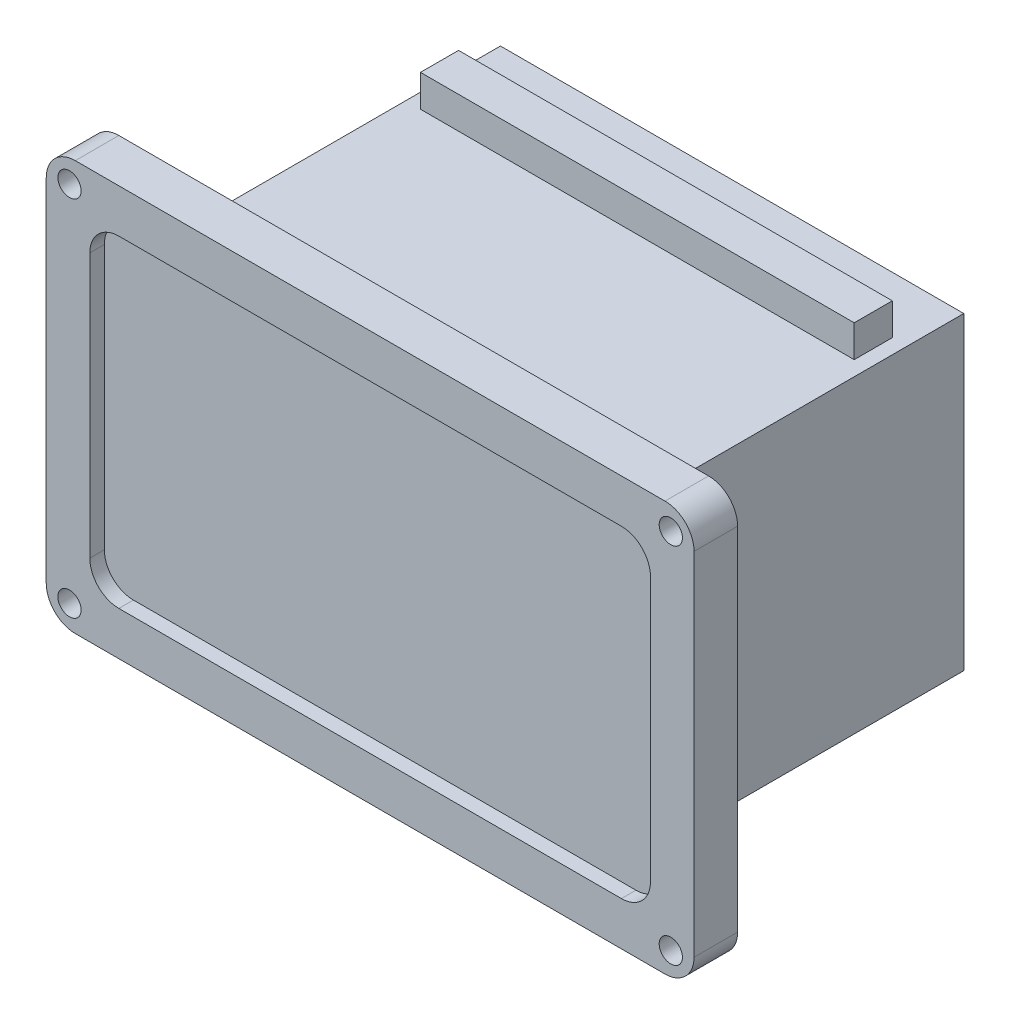
ISO-10303-21;
HEADER;
FILE_DESCRIPTION(('STEP AP214'),'2;1');
FILE_NAME('part.step','',(''),(''),'','','');
FILE_SCHEMA(('AUTOMOTIVE_DESIGN { 1 0 10303 214 1 1 1 1 }'));
ENDSEC;
DATA;
#1=APPLICATION_CONTEXT('core data for automotive mechanical design processes');
#2=APPLICATION_PROTOCOL_DEFINITION('international standard','automotive_design',2000,#1);
#3=PRODUCT_CONTEXT('',#1,'mechanical');
#4=PRODUCT('Part','Part','',(#3));
#5=PRODUCT_RELATED_PRODUCT_CATEGORY('part','',(#4));
#6=PRODUCT_DEFINITION_FORMATION('','',#4);
#7=PRODUCT_DEFINITION_CONTEXT('part definition',#1,'design');
#8=PRODUCT_DEFINITION('design','',#6,#7);
#9=PRODUCT_DEFINITION_SHAPE('','',#8);
#10=(LENGTH_UNIT() NAMED_UNIT(*) SI_UNIT(.MILLI.,.METRE.));
#11=(NAMED_UNIT(*) PLANE_ANGLE_UNIT() SI_UNIT($,.RADIAN.));
#12=(NAMED_UNIT(*) SI_UNIT($,.STERADIAN.) SOLID_ANGLE_UNIT());
#13=UNCERTAINTY_MEASURE_WITH_UNIT(LENGTH_MEASURE(1.E-05),#10,'distance_accuracy_value','');
#14=(GEOMETRIC_REPRESENTATION_CONTEXT(3) GLOBAL_UNCERTAINTY_ASSIGNED_CONTEXT((#13)) GLOBAL_UNIT_ASSIGNED_CONTEXT((#10,
#11,#12)) REPRESENTATION_CONTEXT('',''));
#15=CARTESIAN_POINT('',(0.,0.,0.));
#16=DIRECTION('',(0.,0.,1.));
#17=DIRECTION('',(1.,0.,0.));
#18=AXIS2_PLACEMENT_3D('',#15,#16,#17);
#19=CARTESIAN_POINT('',(79.75,53.25,-109.6));
#20=DIRECTION('',(0.,-1.,0.));
#21=DIRECTION('',(0.,0.,-1.));
#22=AXIS2_PLACEMENT_3D('',#19,#20,#21);
#23=PLANE('',#22);
#24=DIRECTION('',(1.,0.,0.));
#25=VECTOR('',#24,1.);
#26=CARTESIAN_POINT('',(79.75,53.25,0.));
#27=LINE('',#26,#25);
#28=CARTESIAN_POINT('',(-79.75,53.25,0.));
#29=VERTEX_POINT('',#28);
#30=CARTESIAN_POINT('',(79.75,53.25,0.));
#31=VERTEX_POINT('',#30);
#32=EDGE_CURVE('E324',#29,#31,#27,.T.);
#33=ORIENTED_EDGE('',*,*,#32,.T.);
#34=DIRECTION('',(0.,0.,1.));
#35=VECTOR('',#34,1.);
#36=CARTESIAN_POINT('',(79.75,53.25,-109.6));
#37=LINE('',#36,#35);
#38=CARTESIAN_POINT('',(79.75,53.25,-109.6));
#39=VERTEX_POINT('',#38);
#40=EDGE_CURVE('E334',#39,#31,#37,.T.);
#41=ORIENTED_EDGE('',*,*,#40,.F.);
#42=DIRECTION('',(1.,0.,0.));
#43=VECTOR('',#42,1.);
#44=CARTESIAN_POINT('',(79.75,53.25,-109.6));
#45=LINE('',#44,#43);
#46=CARTESIAN_POINT('',(-79.75,53.25,-109.6));
#47=VERTEX_POINT('',#46);
#48=EDGE_CURVE('E314',#47,#39,#45,.T.);
#49=ORIENTED_EDGE('',*,*,#48,.F.);
#50=DIRECTION('',(0.,0.,1.));
#51=VECTOR('',#50,1.);
#52=CARTESIAN_POINT('',(-79.75,53.25,-109.6));
#53=LINE('',#52,#51);
#54=EDGE_CURVE('E337',#47,#29,#53,.T.);
#55=ORIENTED_EDGE('',*,*,#54,.T.);
#56=EDGE_LOOP('',(#33,#41,#49,#55));
#57=FACE_BOUND('',#56,.T.);
#58=DIRECTION('',(0.,0.,-1.));
#59=VECTOR('',#58,1.);
#60=CARTESIAN_POINT('',(74.6572464753419,53.25,-76.9808077450753));
#61=LINE('',#60,#59);
#62=CARTESIAN_POINT('',(74.6572464753419,53.25,-76.9808077450753));
#63=VERTEX_POINT('',#62);
#64=CARTESIAN_POINT('',(74.6572464753419,53.25,-90.0913485895257));
#65=VERTEX_POINT('',#64);
#66=EDGE_CURVE('E216',#63,#65,#61,.T.);
#67=ORIENTED_EDGE('',*,*,#66,.F.);
#68=DIRECTION('',(1.,0.,0.));
#69=VECTOR('',#68,1.);
#70=CARTESIAN_POINT('',(-74.6572464753419,53.25,-76.9808077450753));
#71=LINE('',#70,#69);
#72=CARTESIAN_POINT('',(-74.657246475342,53.25,-76.9808077450753));
#73=VERTEX_POINT('',#72);
#74=EDGE_CURVE('E213',#73,#63,#71,.T.);
#75=ORIENTED_EDGE('',*,*,#74,.F.);
#76=DIRECTION('',(0.,0.,1.));
#77=VECTOR('',#76,1.);
#78=CARTESIAN_POINT('',(-74.6572464753419,53.25,-76.9808077450753));
#79=LINE('',#78,#77);
#80=CARTESIAN_POINT('',(-74.6572464753419,53.25,-90.0913485895257));
#81=VERTEX_POINT('',#80);
#82=EDGE_CURVE('E55',#81,#73,#79,.T.);
#83=ORIENTED_EDGE('',*,*,#82,.F.);
#84=DIRECTION('',(-1.,0.,0.));
#85=VECTOR('',#84,1.);
#86=CARTESIAN_POINT('',(-74.6572464753419,53.25,-90.0913485895257));
#87=LINE('',#86,#85);
#88=EDGE_CURVE('E50',#65,#81,#87,.T.);
#89=ORIENTED_EDGE('',*,*,#88,.F.);
#90=EDGE_LOOP('',(#67,#75,#83,#89));
#91=FACE_BOUND('',#90,.T.);
#92=ADVANCED_FACE('F35',(#57,#91),#23,.F.);
#93=CARTESIAN_POINT('',(-101.5,-60.5,0.));
#94=DIRECTION('',(0.,0.,-1.));
#95=DIRECTION('',(-1.,0.,0.));
#96=AXIS2_PLACEMENT_3D('',#93,#94,#95);
#97=PLANE('',#96);
#98=CARTESIAN_POINT('',(103.5,62.4999999999999,0.));
#99=DIRECTION('',(0.,0.,1.));
#100=DIRECTION('',(-1.,0.,0.));
#101=AXIS2_PLACEMENT_3D('',#98,#99,#100);
#102=CIRCLE('',#101,4.00000000000001);
#103=CARTESIAN_POINT('',(99.5,62.4999999999999,0.));
#104=VERTEX_POINT('',#103);
#105=EDGE_CURVE('E226',#104,#104,#102,.T.);
#106=ORIENTED_EDGE('',*,*,#105,.T.);
#107=EDGE_LOOP('',(#106));
#108=FACE_BOUND('',#107,.T.);
#109=CARTESIAN_POINT('',(103.5,-62.4999999999999,0.));
#110=DIRECTION('',(0.,0.,1.));
#111=DIRECTION('',(1.,0.,0.));
#112=AXIS2_PLACEMENT_3D('',#109,#110,#111);
#113=CIRCLE('',#112,4.00000000000001);
#114=CARTESIAN_POINT('',(107.5,-62.4999999999999,0.));
#115=VERTEX_POINT('',#114);
#116=EDGE_CURVE('E233',#115,#115,#113,.T.);
#117=ORIENTED_EDGE('',*,*,#116,.T.);
#118=EDGE_LOOP('',(#117));
#119=FACE_BOUND('',#118,.T.);
#120=CARTESIAN_POINT('',(-103.5,-62.5,0.));
#121=DIRECTION('',(0.,0.,1.));
#122=DIRECTION('',(-1.,0.,0.));
#123=AXIS2_PLACEMENT_3D('',#120,#121,#122);
#124=CIRCLE('',#123,4.00000000000001);
#125=CARTESIAN_POINT('',(-107.5,-62.5,0.));
#126=VERTEX_POINT('',#125);
#127=EDGE_CURVE('E220',#126,#126,#124,.T.);
#128=ORIENTED_EDGE('',*,*,#127,.T.);
#129=EDGE_LOOP('',(#128));
#130=FACE_BOUND('',#129,.T.);
#131=CARTESIAN_POINT('',(-103.5,62.5,0.));
#132=DIRECTION('',(0.,0.,1.));
#133=DIRECTION('',(1.,0.,0.));
#134=AXIS2_PLACEMENT_3D('',#131,#132,#133);
#135=CIRCLE('',#134,4.00000000000001);
#136=CARTESIAN_POINT('',(-99.5,62.5,0.));
#137=VERTEX_POINT('',#136);
#138=EDGE_CURVE('E241',#137,#137,#135,.T.);
#139=ORIENTED_EDGE('',*,*,#138,.T.);
#140=EDGE_LOOP('',(#139));
#141=FACE_BOUND('',#140,.T.);
#142=CARTESIAN_POINT('',(-101.5,-60.5,0.));
#143=DIRECTION('',(0.,0.,1.));
#144=DIRECTION('',(-1.,0.,0.));
#145=AXIS2_PLACEMENT_3D('',#142,#143,#144);
#146=CIRCLE('',#145,10.);
#147=CARTESIAN_POINT('',(-111.5,-60.4999999999999,0.));
#148=VERTEX_POINT('',#147);
#149=CARTESIAN_POINT('',(-101.5,-70.5,0.));
#150=VERTEX_POINT('',#149);
#151=EDGE_CURVE('E339',#148,#150,#146,.T.);
#152=ORIENTED_EDGE('',*,*,#151,.F.);
#153=DIRECTION('',(0.,-1.,0.));
#154=VECTOR('',#153,1.);
#155=CARTESIAN_POINT('',(-111.5,-60.4999999999999,0.));
#156=LINE('',#155,#154);
#157=CARTESIAN_POINT('',(-111.5,60.4999999999999,0.));
#158=VERTEX_POINT('',#157);
#159=EDGE_CURVE('E344',#158,#148,#156,.T.);
#160=ORIENTED_EDGE('',*,*,#159,.F.);
#161=CARTESIAN_POINT('',(-101.5,60.5,0.));
#162=DIRECTION('',(0.,0.,1.));
#163=DIRECTION('',(-1.,0.,0.));
#164=AXIS2_PLACEMENT_3D('',#161,#162,#163);
#165=CIRCLE('',#164,10.);
#166=CARTESIAN_POINT('',(-101.5,70.5,0.));
#167=VERTEX_POINT('',#166);
#168=EDGE_CURVE('E371',#167,#158,#165,.T.);
#169=ORIENTED_EDGE('',*,*,#168,.F.);
#170=DIRECTION('',(-1.,0.,0.));
#171=VECTOR('',#170,1.);
#172=CARTESIAN_POINT('',(-101.5,70.5,0.));
#173=LINE('',#172,#171);
#174=CARTESIAN_POINT('',(101.5,70.5,0.));
#175=VERTEX_POINT('',#174);
#176=EDGE_CURVE('E369',#175,#167,#173,.T.);
#177=ORIENTED_EDGE('',*,*,#176,.F.);
#178=CARTESIAN_POINT('',(101.5,60.5,0.));
#179=DIRECTION('',(0.,0.,1.));
#180=DIRECTION('',(-1.,0.,0.));
#181=AXIS2_PLACEMENT_3D('',#178,#179,#180);
#182=CIRCLE('',#181,10.);
#183=CARTESIAN_POINT('',(111.5,60.4999999999999,0.));
#184=VERTEX_POINT('',#183);
#185=EDGE_CURVE('E367',#184,#175,#182,.T.);
#186=ORIENTED_EDGE('',*,*,#185,.F.);
#187=DIRECTION('',(0.,1.,0.));
#188=VECTOR('',#187,1.);
#189=CARTESIAN_POINT('',(111.5,-60.4999999999999,0.));
#190=LINE('',#189,#188);
#191=CARTESIAN_POINT('',(111.5,-60.5,0.));
#192=VERTEX_POINT('',#191);
#193=EDGE_CURVE('E365',#192,#184,#190,.T.);
#194=ORIENTED_EDGE('',*,*,#193,.F.);
#195=CARTESIAN_POINT('',(101.5,-60.5,0.));
#196=DIRECTION('',(0.,0.,1.));
#197=DIRECTION('',(1.,0.,0.));
#198=AXIS2_PLACEMENT_3D('',#195,#196,#197);
#199=CIRCLE('',#198,10.);
#200=CARTESIAN_POINT('',(101.5,-70.5,0.));
#201=VERTEX_POINT('',#200);
#202=EDGE_CURVE('E363',#201,#192,#199,.T.);
#203=ORIENTED_EDGE('',*,*,#202,.F.);
#204=DIRECTION('',(1.,0.,0.));
#205=VECTOR('',#204,1.);
#206=CARTESIAN_POINT('',(-101.5,-70.5,0.));
#207=LINE('',#206,#205);
#208=EDGE_CURVE('E361',#150,#201,#207,.T.);
#209=ORIENTED_EDGE('',*,*,#208,.F.);
#210=EDGE_LOOP('',(#152,#160,#169,#177,#186,#194,#203,#209));
#211=FACE_BOUND('',#210,.T.);
#212=ORIENTED_EDGE('',*,*,#32,.F.);
#213=DIRECTION('',(0.,1.,0.));
#214=VECTOR('',#213,1.);
#215=CARTESIAN_POINT('',(-79.75,-53.25,0.));
#216=LINE('',#215,#214);
#217=CARTESIAN_POINT('',(-79.75,-53.25,0.));
#218=VERTEX_POINT('',#217);
#219=EDGE_CURVE('E296',#218,#29,#216,.T.);
#220=ORIENTED_EDGE('',*,*,#219,.F.);
#221=DIRECTION('',(-1.,0.,0.));
#222=VECTOR('',#221,1.);
#223=CARTESIAN_POINT('',(79.75,-53.25,0.));
#224=LINE('',#223,#222);
#225=CARTESIAN_POINT('',(79.75,-53.25,0.));
#226=VERTEX_POINT('',#225);
#227=EDGE_CURVE('E315',#226,#218,#224,.T.);
#228=ORIENTED_EDGE('',*,*,#227,.F.);
#229=DIRECTION('',(0.,-1.,0.));
#230=VECTOR('',#229,1.);
#231=CARTESIAN_POINT('',(79.75,-53.25,0.));
#232=LINE('',#231,#230);
#233=EDGE_CURVE('E326',#31,#226,#232,.T.);
#234=ORIENTED_EDGE('',*,*,#233,.F.);
#235=EDGE_LOOP('',(#212,#220,#228,#234));
#236=FACE_BOUND('',#235,.T.);
#237=ADVANCED_FACE('F401',(#108,#119,#130,#141,#211,#236),#97,.T.);
#238=CARTESIAN_POINT('',(-101.5,-60.5,15.));
#239=DIRECTION('',(0.,0.,-1.));
#240=DIRECTION('',(-1.,0.,0.));
#241=AXIS2_PLACEMENT_3D('',#238,#239,#240);
#242=CYLINDRICAL_SURFACE('',#241,10.);
#243=ORIENTED_EDGE('',*,*,#151,.T.);
#244=DIRECTION('',(0.,0.,-1.));
#245=VECTOR('',#244,1.);
#246=CARTESIAN_POINT('',(-101.5,-70.5,15.));
#247=LINE('',#246,#245);
#248=CARTESIAN_POINT('',(-101.5,-70.5,15.));
#249=VERTEX_POINT('',#248);
#250=EDGE_CURVE('E11',#249,#150,#247,.T.);
#251=ORIENTED_EDGE('',*,*,#250,.F.);
#252=CARTESIAN_POINT('',(-101.5,-60.5,15.));
#253=DIRECTION('',(0.,0.,1.));
#254=DIRECTION('',(-1.,0.,0.));
#255=AXIS2_PLACEMENT_3D('',#252,#253,#254);
#256=CIRCLE('',#255,10.);
#257=CARTESIAN_POINT('',(-111.5,-60.4999999999999,15.));
#258=VERTEX_POINT('',#257);
#259=EDGE_CURVE('E340',#258,#249,#256,.T.);
#260=ORIENTED_EDGE('',*,*,#259,.F.);
#261=DIRECTION('',(0.,0.,-1.));
#262=VECTOR('',#261,1.);
#263=CARTESIAN_POINT('',(-111.5,-60.4999999999999,15.));
#264=LINE('',#263,#262);
#265=EDGE_CURVE('E358',#258,#148,#264,.T.);
#266=ORIENTED_EDGE('',*,*,#265,.T.);
#267=EDGE_LOOP('',(#243,#251,#260,#266));
#268=FACE_BOUND('',#267,.T.);
#269=ADVANCED_FACE('F37',(#268),#242,.T.);
#270=CARTESIAN_POINT('',(-101.5,-70.5,15.));
#271=DIRECTION('',(0.,1.,0.));
#272=DIRECTION('',(0.,0.,1.));
#273=AXIS2_PLACEMENT_3D('',#270,#271,#272);
#274=PLANE('',#273);
#275=ORIENTED_EDGE('',*,*,#208,.T.);
#276=DIRECTION('',(0.,0.,-1.));
#277=VECTOR('',#276,1.);
#278=CARTESIAN_POINT('',(101.5,-70.5,15.));
#279=LINE('',#278,#277);
#280=CARTESIAN_POINT('',(101.5,-70.5,15.));
#281=VERTEX_POINT('',#280);
#282=EDGE_CURVE('E43',#281,#201,#279,.T.);
#283=ORIENTED_EDGE('',*,*,#282,.F.);
#284=DIRECTION('',(1.,0.,0.));
#285=VECTOR('',#284,1.);
#286=CARTESIAN_POINT('',(-101.5,-70.5,15.));
#287=LINE('',#286,#285);
#288=EDGE_CURVE('E343',#249,#281,#287,.T.);
#289=ORIENTED_EDGE('',*,*,#288,.F.);
#290=ORIENTED_EDGE('',*,*,#250,.T.);
#291=EDGE_LOOP('',(#275,#283,#289,#290));
#292=FACE_BOUND('',#291,.T.);
#293=ADVANCED_FACE('F419',(#292),#274,.F.);
#294=CARTESIAN_POINT('',(101.5,-60.5,15.));
#295=DIRECTION('',(0.,0.,-1.));
#296=DIRECTION('',(-1.,0.,0.));
#297=AXIS2_PLACEMENT_3D('',#294,#295,#296);
#298=CYLINDRICAL_SURFACE('',#297,10.);
#299=ORIENTED_EDGE('',*,*,#202,.T.);
#300=DIRECTION('',(0.,0.,-1.));
#301=VECTOR('',#300,1.);
#302=CARTESIAN_POINT('',(111.5,-60.5,15.));
#303=LINE('',#302,#301);
#304=CARTESIAN_POINT('',(111.5,-60.5,15.));
#305=VERTEX_POINT('',#304);
#306=EDGE_CURVE('E388',#305,#192,#303,.T.);
#307=ORIENTED_EDGE('',*,*,#306,.F.);
#308=CARTESIAN_POINT('',(101.5,-60.5,15.));
#309=DIRECTION('',(0.,0.,1.));
#310=DIRECTION('',(1.,0.,0.));
#311=AXIS2_PLACEMENT_3D('',#308,#309,#310);
#312=CIRCLE('',#311,10.);
#313=EDGE_CURVE('E346',#281,#305,#312,.T.);
#314=ORIENTED_EDGE('',*,*,#313,.F.);
#315=ORIENTED_EDGE('',*,*,#282,.T.);
#316=EDGE_LOOP('',(#299,#307,#314,#315));
#317=FACE_BOUND('',#316,.T.);
#318=ADVANCED_FACE('F395',(#317),#298,.T.);
#319=CARTESIAN_POINT('',(111.5,-60.4999999999999,15.));
#320=DIRECTION('',(-1.,0.,0.));
#321=DIRECTION('',(0.,0.,1.));
#322=AXIS2_PLACEMENT_3D('',#319,#320,#321);
#323=PLANE('',#322);
#324=ORIENTED_EDGE('',*,*,#193,.T.);
#325=DIRECTION('',(0.,0.,-1.));
#326=VECTOR('',#325,1.);
#327=CARTESIAN_POINT('',(111.5,60.4999999999999,15.));
#328=LINE('',#327,#326);
#329=CARTESIAN_POINT('',(111.5,60.4999999999999,15.));
#330=VERTEX_POINT('',#329);
#331=EDGE_CURVE('E385',#330,#184,#328,.T.);
#332=ORIENTED_EDGE('',*,*,#331,.F.);
#333=DIRECTION('',(0.,1.,0.));
#334=VECTOR('',#333,1.);
#335=CARTESIAN_POINT('',(111.5,-60.4999999999999,15.));
#336=LINE('',#335,#334);
#337=EDGE_CURVE('E348',#305,#330,#336,.T.);
#338=ORIENTED_EDGE('',*,*,#337,.F.);
#339=ORIENTED_EDGE('',*,*,#306,.T.);
#340=EDGE_LOOP('',(#324,#332,#338,#339));
#341=FACE_BOUND('',#340,.T.);
#342=ADVANCED_FACE('F407',(#341),#323,.F.);
#343=CARTESIAN_POINT('',(101.5,60.5,15.));
#344=DIRECTION('',(0.,0.,-1.));
#345=DIRECTION('',(-1.,0.,0.));
#346=AXIS2_PLACEMENT_3D('',#343,#344,#345);
#347=CYLINDRICAL_SURFACE('',#346,10.);
#348=ORIENTED_EDGE('',*,*,#185,.T.);
#349=DIRECTION('',(0.,0.,-1.));
#350=VECTOR('',#349,1.);
#351=CARTESIAN_POINT('',(101.5,70.5,15.));
#352=LINE('',#351,#350);
#353=CARTESIAN_POINT('',(101.5,70.5,15.));
#354=VERTEX_POINT('',#353);
#355=EDGE_CURVE('E382',#354,#175,#352,.T.);
#356=ORIENTED_EDGE('',*,*,#355,.F.);
#357=CARTESIAN_POINT('',(101.5,60.5,15.));
#358=DIRECTION('',(0.,0.,1.));
#359=DIRECTION('',(-1.,0.,0.));
#360=AXIS2_PLACEMENT_3D('',#357,#358,#359);
#361=CIRCLE('',#360,10.);
#362=EDGE_CURVE('E350',#330,#354,#361,.T.);
#363=ORIENTED_EDGE('',*,*,#362,.F.);
#364=ORIENTED_EDGE('',*,*,#331,.T.);
#365=EDGE_LOOP('',(#348,#356,#363,#364));
#366=FACE_BOUND('',#365,.T.);
#367=ADVANCED_FACE('F411',(#366),#347,.T.);
#368=CARTESIAN_POINT('',(-101.5,70.5,15.));
#369=DIRECTION('',(0.,-1.,0.));
#370=DIRECTION('',(0.,0.,-1.));
#371=AXIS2_PLACEMENT_3D('',#368,#369,#370);
#372=PLANE('',#371);
#373=ORIENTED_EDGE('',*,*,#176,.T.);
#374=DIRECTION('',(0.,0.,-1.));
#375=VECTOR('',#374,1.);
#376=CARTESIAN_POINT('',(-101.5,70.5,15.));
#377=LINE('',#376,#375);
#378=CARTESIAN_POINT('',(-101.5,70.5,15.));
#379=VERTEX_POINT('',#378);
#380=EDGE_CURVE('E379',#379,#167,#377,.T.);
#381=ORIENTED_EDGE('',*,*,#380,.F.);
#382=DIRECTION('',(-1.,0.,0.));
#383=VECTOR('',#382,1.);
#384=CARTESIAN_POINT('',(-101.5,70.5,15.));
#385=LINE('',#384,#383);
#386=EDGE_CURVE('E352',#354,#379,#385,.T.);
#387=ORIENTED_EDGE('',*,*,#386,.F.);
#388=ORIENTED_EDGE('',*,*,#355,.T.);
#389=EDGE_LOOP('',(#373,#381,#387,#388));
#390=FACE_BOUND('',#389,.T.);
#391=ADVANCED_FACE('F432',(#390),#372,.F.);
#392=CARTESIAN_POINT('',(-101.5,60.5,15.));
#393=DIRECTION('',(0.,0.,-1.));
#394=DIRECTION('',(-1.,0.,0.));
#395=AXIS2_PLACEMENT_3D('',#392,#393,#394);
#396=CYLINDRICAL_SURFACE('',#395,10.);
#397=ORIENTED_EDGE('',*,*,#168,.T.);
#398=DIRECTION('',(0.,0.,-1.));
#399=VECTOR('',#398,1.);
#400=CARTESIAN_POINT('',(-111.5,60.4999999999999,15.));
#401=LINE('',#400,#399);
#402=CARTESIAN_POINT('',(-111.5,60.4999999999999,15.));
#403=VERTEX_POINT('',#402);
#404=EDGE_CURVE('E376',#403,#158,#401,.T.);
#405=ORIENTED_EDGE('',*,*,#404,.F.);
#406=CARTESIAN_POINT('',(-101.5,60.5,15.));
#407=DIRECTION('',(0.,0.,1.));
#408=DIRECTION('',(-1.,0.,0.));
#409=AXIS2_PLACEMENT_3D('',#406,#407,#408);
#410=CIRCLE('',#409,10.);
#411=EDGE_CURVE('E354',#379,#403,#410,.T.);
#412=ORIENTED_EDGE('',*,*,#411,.F.);
#413=ORIENTED_EDGE('',*,*,#380,.T.);
#414=EDGE_LOOP('',(#397,#405,#412,#413));
#415=FACE_BOUND('',#414,.T.);
#416=ADVANCED_FACE('F430',(#415),#396,.T.);
#417=CARTESIAN_POINT('',(-111.5,-60.4999999999999,15.));
#418=DIRECTION('',(1.,0.,0.));
#419=DIRECTION('',(0.,0.,-1.));
#420=AXIS2_PLACEMENT_3D('',#417,#418,#419);
#421=PLANE('',#420);
#422=ORIENTED_EDGE('',*,*,#159,.T.);
#423=ORIENTED_EDGE('',*,*,#265,.F.);
#424=DIRECTION('',(0.,-1.,0.));
#425=VECTOR('',#424,1.);
#426=CARTESIAN_POINT('',(-111.5,-60.4999999999999,15.));
#427=LINE('',#426,#425);
#428=EDGE_CURVE('E356',#403,#258,#427,.T.);
#429=ORIENTED_EDGE('',*,*,#428,.F.);
#430=ORIENTED_EDGE('',*,*,#404,.T.);
#431=EDGE_LOOP('',(#422,#423,#429,#430));
#432=FACE_BOUND('',#431,.T.);
#433=ADVANCED_FACE('F425',(#432),#421,.F.);
#434=CARTESIAN_POINT('',(-101.5,-60.5,15.));
#435=DIRECTION('',(0.,0.,-1.));
#436=DIRECTION('',(-1.,0.,0.));
#437=AXIS2_PLACEMENT_3D('',#434,#435,#436);
#438=PLANE('',#437);
#439=CARTESIAN_POINT('',(103.5,62.4999999999999,15.));
#440=DIRECTION('',(0.,0.,1.));
#441=DIRECTION('',(-1.,0.,0.));
#442=AXIS2_PLACEMENT_3D('',#439,#440,#441);
#443=CIRCLE('',#442,4.00000000000001);
#444=CARTESIAN_POINT('',(99.5,62.4999999999999,15.));
#445=VERTEX_POINT('',#444);
#446=EDGE_CURVE('E230',#445,#445,#443,.T.);
#447=ORIENTED_EDGE('',*,*,#446,.F.);
#448=EDGE_LOOP('',(#447));
#449=FACE_BOUND('',#448,.T.);
#450=CARTESIAN_POINT('',(103.5,-62.4999999999999,15.));
#451=DIRECTION('',(0.,0.,1.));
#452=DIRECTION('',(1.,0.,0.));
#453=AXIS2_PLACEMENT_3D('',#450,#451,#452);
#454=CIRCLE('',#453,4.00000000000001);
#455=CARTESIAN_POINT('',(107.5,-62.4999999999999,15.));
#456=VERTEX_POINT('',#455);
#457=EDGE_CURVE('E236',#456,#456,#454,.T.);
#458=ORIENTED_EDGE('',*,*,#457,.F.);
#459=EDGE_LOOP('',(#458));
#460=FACE_BOUND('',#459,.T.);
#461=CARTESIAN_POINT('',(-103.5,-62.5,15.));
#462=DIRECTION('',(0.,0.,1.));
#463=DIRECTION('',(-1.,0.,0.));
#464=AXIS2_PLACEMENT_3D('',#461,#462,#463);
#465=CIRCLE('',#464,4.00000000000001);
#466=CARTESIAN_POINT('',(-107.5,-62.5,15.));
#467=VERTEX_POINT('',#466);
#468=EDGE_CURVE('E217',#467,#467,#465,.T.);
#469=ORIENTED_EDGE('',*,*,#468,.F.);
#470=EDGE_LOOP('',(#469));
#471=FACE_BOUND('',#470,.T.);
#472=CARTESIAN_POINT('',(-103.5,62.5,15.));
#473=DIRECTION('',(0.,0.,1.));
#474=DIRECTION('',(1.,0.,0.));
#475=AXIS2_PLACEMENT_3D('',#472,#473,#474);
#476=CIRCLE('',#475,4.00000000000001);
#477=CARTESIAN_POINT('',(-99.5,62.5,15.));
#478=VERTEX_POINT('',#477);
#479=EDGE_CURVE('E229',#478,#478,#476,.T.);
#480=ORIENTED_EDGE('',*,*,#479,.F.);
#481=EDGE_LOOP('',(#480));
#482=FACE_BOUND('',#481,.T.);
#483=DIRECTION('',(1.,0.,0.));
#484=VECTOR('',#483,1.);
#485=CARTESIAN_POINT('',(86.4999999999999,-55.5,15.));
#486=LINE('',#485,#484);
#487=CARTESIAN_POINT('',(-86.4999999999999,-55.5,15.));
#488=VERTEX_POINT('',#487);
#489=CARTESIAN_POINT('',(86.4999999999999,-55.5,15.));
#490=VERTEX_POINT('',#489);
#491=EDGE_CURVE('E274',#488,#490,#486,.T.);
#492=ORIENTED_EDGE('',*,*,#491,.F.);
#493=CARTESIAN_POINT('',(-86.5,-45.5,15.));
#494=DIRECTION('',(0.,0.,1.));
#495=DIRECTION('',(-1.,0.,0.));
#496=AXIS2_PLACEMENT_3D('',#493,#494,#495);
#497=CIRCLE('',#496,10.);
#498=CARTESIAN_POINT('',(-96.5,-45.4999999999999,15.));
#499=VERTEX_POINT('',#498);
#500=EDGE_CURVE('E244',#499,#488,#497,.T.);
#501=ORIENTED_EDGE('',*,*,#500,.F.);
#502=DIRECTION('',(0.,-1.,0.));
#503=VECTOR('',#502,1.);
#504=CARTESIAN_POINT('',(-96.5,-45.4999999999999,15.));
#505=LINE('',#504,#503);
#506=CARTESIAN_POINT('',(-96.5,45.4999999999999,15.));
#507=VERTEX_POINT('',#506);
#508=EDGE_CURVE('E251',#507,#499,#505,.T.);
#509=ORIENTED_EDGE('',*,*,#508,.F.);
#510=CARTESIAN_POINT('',(-86.5,45.5,15.));
#511=DIRECTION('',(0.,0.,1.));
#512=DIRECTION('',(1.,0.,0.));
#513=AXIS2_PLACEMENT_3D('',#510,#511,#512);
#514=CIRCLE('',#513,10.);
#515=CARTESIAN_POINT('',(-86.4999999999999,55.5,15.));
#516=VERTEX_POINT('',#515);
#517=EDGE_CURVE('E289',#516,#507,#514,.T.);
#518=ORIENTED_EDGE('',*,*,#517,.F.);
#519=DIRECTION('',(-1.,0.,0.));
#520=VECTOR('',#519,1.);
#521=CARTESIAN_POINT('',(86.4999999999999,55.5,15.));
#522=LINE('',#521,#520);
#523=CARTESIAN_POINT('',(86.4999999999999,55.5,15.));
#524=VERTEX_POINT('',#523);
#525=EDGE_CURVE('E286',#524,#516,#522,.T.);
#526=ORIENTED_EDGE('',*,*,#525,.F.);
#527=CARTESIAN_POINT('',(86.5,45.5,15.));
#528=DIRECTION('',(0.,0.,1.));
#529=DIRECTION('',(1.,0.,0.));
#530=AXIS2_PLACEMENT_3D('',#527,#528,#529);
#531=CIRCLE('',#530,10.);
#532=CARTESIAN_POINT('',(96.5,45.4999999999999,15.));
#533=VERTEX_POINT('',#532);
#534=EDGE_CURVE('E283',#533,#524,#531,.T.);
#535=ORIENTED_EDGE('',*,*,#534,.F.);
#536=DIRECTION('',(0.,1.,0.));
#537=VECTOR('',#536,1.);
#538=CARTESIAN_POINT('',(96.5,-45.4999999999999,15.));
#539=LINE('',#538,#537);
#540=CARTESIAN_POINT('',(96.5,-45.5,15.));
#541=VERTEX_POINT('',#540);
#542=EDGE_CURVE('E280',#541,#533,#539,.T.);
#543=ORIENTED_EDGE('',*,*,#542,.F.);
#544=CARTESIAN_POINT('',(86.5,-45.5,15.));
#545=DIRECTION('',(0.,0.,1.));
#546=DIRECTION('',(1.,0.,0.));
#547=AXIS2_PLACEMENT_3D('',#544,#545,#546);
#548=CIRCLE('',#547,10.);
#549=EDGE_CURVE('E277',#490,#541,#548,.T.);
#550=ORIENTED_EDGE('',*,*,#549,.F.);
#551=EDGE_LOOP('',(#492,#501,#509,#518,#526,#535,#543,#550));
#552=FACE_BOUND('',#551,.T.);
#553=ORIENTED_EDGE('',*,*,#259,.T.);
#554=ORIENTED_EDGE('',*,*,#288,.T.);
#555=ORIENTED_EDGE('',*,*,#313,.T.);
#556=ORIENTED_EDGE('',*,*,#337,.T.);
#557=ORIENTED_EDGE('',*,*,#362,.T.);
#558=ORIENTED_EDGE('',*,*,#386,.T.);
#559=ORIENTED_EDGE('',*,*,#411,.T.);
#560=ORIENTED_EDGE('',*,*,#428,.T.);
#561=EDGE_LOOP('',(#553,#554,#555,#556,#557,#558,#559,#560));
#562=FACE_BOUND('',#561,.T.);
#563=ADVANCED_FACE('F415',(#449,#460,#471,#482,#552,#562),#438,.F.);
#564=CARTESIAN_POINT('',(-79.75,-53.25,-109.6));
#565=DIRECTION('',(1.,0.,0.));
#566=DIRECTION('',(0.,0.,-1.));
#567=AXIS2_PLACEMENT_3D('',#564,#565,#566);
#568=PLANE('',#567);
#569=ORIENTED_EDGE('',*,*,#219,.T.);
#570=ORIENTED_EDGE('',*,*,#54,.F.);
#571=DIRECTION('',(0.,1.,0.));
#572=VECTOR('',#571,1.);
#573=CARTESIAN_POINT('',(-79.75,-53.25,-109.6));
#574=LINE('',#573,#572);
#575=CARTESIAN_POINT('',(-79.75,-53.25,-109.6));
#576=VERTEX_POINT('',#575);
#577=EDGE_CURVE('E311',#576,#47,#574,.T.);
#578=ORIENTED_EDGE('',*,*,#577,.F.);
#579=DIRECTION('',(0.,0.,1.));
#580=VECTOR('',#579,1.);
#581=CARTESIAN_POINT('',(-79.75,-53.25,-109.6));
#582=LINE('',#581,#580);
#583=EDGE_CURVE('E321',#576,#218,#582,.T.);
#584=ORIENTED_EDGE('',*,*,#583,.T.);
#585=EDGE_LOOP('',(#569,#570,#578,#584));
#586=FACE_BOUND('',#585,.T.);
#587=ADVANCED_FACE('F453',(#586),#568,.F.);
#588=CARTESIAN_POINT('',(79.75,-53.25,-109.6));
#589=DIRECTION('',(-1.,0.,0.));
#590=DIRECTION('',(0.,0.,1.));
#591=AXIS2_PLACEMENT_3D('',#588,#589,#590);
#592=PLANE('',#591);
#593=ORIENTED_EDGE('',*,*,#233,.T.);
#594=DIRECTION('',(0.,0.,1.));
#595=VECTOR('',#594,1.);
#596=CARTESIAN_POINT('',(79.75,-53.25,-109.6));
#597=LINE('',#596,#595);
#598=CARTESIAN_POINT('',(79.75,-53.25,-109.6));
#599=VERTEX_POINT('',#598);
#600=EDGE_CURVE('E332',#599,#226,#597,.T.);
#601=ORIENTED_EDGE('',*,*,#600,.F.);
#602=DIRECTION('',(0.,-1.,0.));
#603=VECTOR('',#602,1.);
#604=CARTESIAN_POINT('',(79.75,-53.25,-109.6));
#605=LINE('',#604,#603);
#606=EDGE_CURVE('E317',#39,#599,#605,.T.);
#607=ORIENTED_EDGE('',*,*,#606,.F.);
#608=ORIENTED_EDGE('',*,*,#40,.T.);
#609=EDGE_LOOP('',(#593,#601,#607,#608));
#610=FACE_BOUND('',#609,.T.);
#611=ADVANCED_FACE('F451',(#610),#592,.F.);
#612=CARTESIAN_POINT('',(79.75,-53.25,-109.6));
#613=DIRECTION('',(0.,1.,0.));
#614=DIRECTION('',(0.,0.,1.));
#615=AXIS2_PLACEMENT_3D('',#612,#613,#614);
#616=PLANE('',#615);
#617=ORIENTED_EDGE('',*,*,#227,.T.);
#618=ORIENTED_EDGE('',*,*,#583,.F.);
#619=DIRECTION('',(-1.,0.,0.));
#620=VECTOR('',#619,1.);
#621=CARTESIAN_POINT('',(79.75,-53.25,-109.6));
#622=LINE('',#621,#620);
#623=EDGE_CURVE('E319',#599,#576,#622,.T.);
#624=ORIENTED_EDGE('',*,*,#623,.F.);
#625=ORIENTED_EDGE('',*,*,#600,.T.);
#626=EDGE_LOOP('',(#617,#618,#624,#625));
#627=FACE_BOUND('',#626,.T.);
#628=ADVANCED_FACE('F481',(#627),#616,.F.);
#629=CARTESIAN_POINT('',(0.,0.,-109.6));
#630=DIRECTION('',(0.,0.,1.));
#631=DIRECTION('',(1.,0.,0.));
#632=AXIS2_PLACEMENT_3D('',#629,#630,#631);
#633=PLANE('',#632);
#634=ORIENTED_EDGE('',*,*,#577,.T.);
#635=ORIENTED_EDGE('',*,*,#48,.T.);
#636=ORIENTED_EDGE('',*,*,#606,.T.);
#637=ORIENTED_EDGE('',*,*,#623,.T.);
#638=EDGE_LOOP('',(#634,#635,#636,#637));
#639=FACE_BOUND('',#638,.T.);
#640=ADVANCED_FACE('F488',(#639),#633,.F.);
#641=CARTESIAN_POINT('',(-86.5,-45.5,10.));
#642=DIRECTION('',(0.,0.,1.));
#643=DIRECTION('',(1.,0.,0.));
#644=AXIS2_PLACEMENT_3D('',#641,#642,#643);
#645=CYLINDRICAL_SURFACE('',#644,10.);
#646=ORIENTED_EDGE('',*,*,#500,.T.);
#647=DIRECTION('',(0.,0.,1.));
#648=VECTOR('',#647,1.);
#649=CARTESIAN_POINT('',(-86.4999999999999,-55.5,10.));
#650=LINE('',#649,#648);
#651=CARTESIAN_POINT('',(-86.4999999999999,-55.5,10.));
#652=VERTEX_POINT('',#651);
#653=EDGE_CURVE('E272',#652,#488,#650,.T.);
#654=ORIENTED_EDGE('',*,*,#653,.F.);
#655=CARTESIAN_POINT('',(-86.5,-45.5,10.));
#656=DIRECTION('',(0.,0.,1.));
#657=DIRECTION('',(-1.,0.,0.));
#658=AXIS2_PLACEMENT_3D('',#655,#656,#657);
#659=CIRCLE('',#658,10.);
#660=CARTESIAN_POINT('',(-96.5,-45.4999999999999,10.));
#661=VERTEX_POINT('',#660);
#662=EDGE_CURVE('E247',#661,#652,#659,.T.);
#663=ORIENTED_EDGE('',*,*,#662,.F.);
#664=DIRECTION('',(0.,0.,1.));
#665=VECTOR('',#664,1.);
#666=CARTESIAN_POINT('',(-96.5,-45.4999999999999,10.));
#667=LINE('',#666,#665);
#668=EDGE_CURVE('E294',#661,#499,#667,.T.);
#669=ORIENTED_EDGE('',*,*,#668,.T.);
#670=EDGE_LOOP('',(#646,#654,#663,#669));
#671=FACE_BOUND('',#670,.T.);
#672=ADVANCED_FACE('F495',(#671),#645,.F.);
#673=CARTESIAN_POINT('',(-96.5,-45.4999999999999,10.));
#674=DIRECTION('',(-1.,0.,0.));
#675=DIRECTION('',(0.,0.,1.));
#676=AXIS2_PLACEMENT_3D('',#673,#674,#675);
#677=PLANE('',#676);
#678=ORIENTED_EDGE('',*,*,#508,.T.);
#679=ORIENTED_EDGE('',*,*,#668,.F.);
#680=DIRECTION('',(0.,-1.,0.));
#681=VECTOR('',#680,1.);
#682=CARTESIAN_POINT('',(-96.5,-45.4999999999999,10.));
#683=LINE('',#682,#681);
#684=CARTESIAN_POINT('',(-96.5,45.4999999999999,10.));
#685=VERTEX_POINT('',#684);
#686=EDGE_CURVE('E269',#685,#661,#683,.T.);
#687=ORIENTED_EDGE('',*,*,#686,.F.);
#688=DIRECTION('',(0.,0.,1.));
#689=VECTOR('',#688,1.);
#690=CARTESIAN_POINT('',(-96.5,45.4999999999999,10.));
#691=LINE('',#690,#689);
#692=EDGE_CURVE('E297',#685,#507,#691,.T.);
#693=ORIENTED_EDGE('',*,*,#692,.T.);
#694=EDGE_LOOP('',(#678,#679,#687,#693));
#695=FACE_BOUND('',#694,.T.);
#696=ADVANCED_FACE('F503',(#695),#677,.F.);
#697=CARTESIAN_POINT('',(-86.5,45.5,10.));
#698=DIRECTION('',(0.,0.,1.));
#699=DIRECTION('',(1.,0.,0.));
#700=AXIS2_PLACEMENT_3D('',#697,#698,#699);
#701=CYLINDRICAL_SURFACE('',#700,10.);
#702=ORIENTED_EDGE('',*,*,#517,.T.);
#703=ORIENTED_EDGE('',*,*,#692,.F.);
#704=CARTESIAN_POINT('',(-86.5,45.5,10.));
#705=DIRECTION('',(0.,0.,1.));
#706=DIRECTION('',(1.,0.,0.));
#707=AXIS2_PLACEMENT_3D('',#704,#705,#706);
#708=CIRCLE('',#707,10.);
#709=CARTESIAN_POINT('',(-86.4999999999999,55.5,10.));
#710=VERTEX_POINT('',#709);
#711=EDGE_CURVE('E266',#710,#685,#708,.T.);
#712=ORIENTED_EDGE('',*,*,#711,.F.);
#713=DIRECTION('',(0.,0.,1.));
#714=VECTOR('',#713,1.);
#715=CARTESIAN_POINT('',(-86.4999999999999,55.5,10.));
#716=LINE('',#715,#714);
#717=EDGE_CURVE('E299',#710,#516,#716,.T.);
#718=ORIENTED_EDGE('',*,*,#717,.T.);
#719=EDGE_LOOP('',(#702,#703,#712,#718));
#720=FACE_BOUND('',#719,.T.);
#721=ADVANCED_FACE('F511',(#720),#701,.F.);
#722=CARTESIAN_POINT('',(86.4999999999999,55.5,10.));
#723=DIRECTION('',(0.,1.,0.));
#724=DIRECTION('',(0.,0.,1.));
#725=AXIS2_PLACEMENT_3D('',#722,#723,#724);
#726=PLANE('',#725);
#727=ORIENTED_EDGE('',*,*,#525,.T.);
#728=ORIENTED_EDGE('',*,*,#717,.F.);
#729=DIRECTION('',(-1.,0.,0.));
#730=VECTOR('',#729,1.);
#731=CARTESIAN_POINT('',(86.4999999999999,55.5,10.));
#732=LINE('',#731,#730);
#733=CARTESIAN_POINT('',(86.4999999999999,55.5,10.));
#734=VERTEX_POINT('',#733);
#735=EDGE_CURVE('E263',#734,#710,#732,.T.);
#736=ORIENTED_EDGE('',*,*,#735,.F.);
#737=DIRECTION('',(0.,0.,1.));
#738=VECTOR('',#737,1.);
#739=CARTESIAN_POINT('',(86.4999999999999,55.5,10.));
#740=LINE('',#739,#738);
#741=EDGE_CURVE('E301',#734,#524,#740,.T.);
#742=ORIENTED_EDGE('',*,*,#741,.T.);
#743=EDGE_LOOP('',(#727,#728,#736,#742));
#744=FACE_BOUND('',#743,.T.);
#745=ADVANCED_FACE('F519',(#744),#726,.F.);
#746=CARTESIAN_POINT('',(86.5,45.5,10.));
#747=DIRECTION('',(0.,0.,1.));
#748=DIRECTION('',(1.,0.,0.));
#749=AXIS2_PLACEMENT_3D('',#746,#747,#748);
#750=CYLINDRICAL_SURFACE('',#749,10.);
#751=ORIENTED_EDGE('',*,*,#534,.T.);
#752=ORIENTED_EDGE('',*,*,#741,.F.);
#753=CARTESIAN_POINT('',(86.5,45.5,10.));
#754=DIRECTION('',(0.,0.,1.));
#755=DIRECTION('',(1.,0.,0.));
#756=AXIS2_PLACEMENT_3D('',#753,#754,#755);
#757=CIRCLE('',#756,10.);
#758=CARTESIAN_POINT('',(96.5,45.4999999999999,10.));
#759=VERTEX_POINT('',#758);
#760=EDGE_CURVE('E260',#759,#734,#757,.T.);
#761=ORIENTED_EDGE('',*,*,#760,.F.);
#762=DIRECTION('',(0.,0.,1.));
#763=VECTOR('',#762,1.);
#764=CARTESIAN_POINT('',(96.5,45.4999999999999,10.));
#765=LINE('',#764,#763);
#766=EDGE_CURVE('E303',#759,#533,#765,.T.);
#767=ORIENTED_EDGE('',*,*,#766,.T.);
#768=EDGE_LOOP('',(#751,#752,#761,#767));
#769=FACE_BOUND('',#768,.T.);
#770=ADVANCED_FACE('F527',(#769),#750,.F.);
#771=CARTESIAN_POINT('',(96.5,-45.4999999999999,10.));
#772=DIRECTION('',(1.,0.,0.));
#773=DIRECTION('',(0.,0.,-1.));
#774=AXIS2_PLACEMENT_3D('',#771,#772,#773);
#775=PLANE('',#774);
#776=ORIENTED_EDGE('',*,*,#542,.T.);
#777=ORIENTED_EDGE('',*,*,#766,.F.);
#778=DIRECTION('',(0.,1.,0.));
#779=VECTOR('',#778,1.);
#780=CARTESIAN_POINT('',(96.5,-45.4999999999999,10.));
#781=LINE('',#780,#779);
#782=CARTESIAN_POINT('',(96.5,-45.5,10.));
#783=VERTEX_POINT('',#782);
#784=EDGE_CURVE('E257',#783,#759,#781,.T.);
#785=ORIENTED_EDGE('',*,*,#784,.F.);
#786=DIRECTION('',(0.,0.,1.));
#787=VECTOR('',#786,1.);
#788=CARTESIAN_POINT('',(96.5,-45.5,10.));
#789=LINE('',#788,#787);
#790=EDGE_CURVE('E305',#783,#541,#789,.T.);
#791=ORIENTED_EDGE('',*,*,#790,.T.);
#792=EDGE_LOOP('',(#776,#777,#785,#791));
#793=FACE_BOUND('',#792,.T.);
#794=ADVANCED_FACE('F535',(#793),#775,.F.);
#795=CARTESIAN_POINT('',(86.5,-45.5,10.));
#796=DIRECTION('',(0.,0.,1.));
#797=DIRECTION('',(1.,0.,0.));
#798=AXIS2_PLACEMENT_3D('',#795,#796,#797);
#799=CYLINDRICAL_SURFACE('',#798,10.);
#800=ORIENTED_EDGE('',*,*,#549,.T.);
#801=ORIENTED_EDGE('',*,*,#790,.F.);
#802=CARTESIAN_POINT('',(86.5,-45.5,10.));
#803=DIRECTION('',(0.,0.,1.));
#804=DIRECTION('',(1.,0.,0.));
#805=AXIS2_PLACEMENT_3D('',#802,#803,#804);
#806=CIRCLE('',#805,10.);
#807=CARTESIAN_POINT('',(86.4999999999999,-55.5,10.));
#808=VERTEX_POINT('',#807);
#809=EDGE_CURVE('E254',#808,#783,#806,.T.);
#810=ORIENTED_EDGE('',*,*,#809,.F.);
#811=DIRECTION('',(0.,0.,1.));
#812=VECTOR('',#811,1.);
#813=CARTESIAN_POINT('',(86.4999999999999,-55.5,10.));
#814=LINE('',#813,#812);
#815=EDGE_CURVE('E307',#808,#490,#814,.T.);
#816=ORIENTED_EDGE('',*,*,#815,.T.);
#817=EDGE_LOOP('',(#800,#801,#810,#816));
#818=FACE_BOUND('',#817,.T.);
#819=ADVANCED_FACE('F543',(#818),#799,.F.);
#820=CARTESIAN_POINT('',(86.4999999999999,-55.5,10.));
#821=DIRECTION('',(0.,-1.,0.));
#822=DIRECTION('',(0.,0.,-1.));
#823=AXIS2_PLACEMENT_3D('',#820,#821,#822);
#824=PLANE('',#823);
#825=ORIENTED_EDGE('',*,*,#491,.T.);
#826=ORIENTED_EDGE('',*,*,#815,.F.);
#827=DIRECTION('',(1.,0.,0.));
#828=VECTOR('',#827,1.);
#829=CARTESIAN_POINT('',(86.4999999999999,-55.5,10.));
#830=LINE('',#829,#828);
#831=EDGE_CURVE('E250',#652,#808,#830,.T.);
#832=ORIENTED_EDGE('',*,*,#831,.F.);
#833=ORIENTED_EDGE('',*,*,#653,.T.);
#834=EDGE_LOOP('',(#825,#826,#832,#833));
#835=FACE_BOUND('',#834,.T.);
#836=ADVANCED_FACE('F551',(#835),#824,.F.);
#837=CARTESIAN_POINT('',(-86.5,-45.5,10.));
#838=DIRECTION('',(0.,0.,-1.));
#839=DIRECTION('',(-1.,0.,0.));
#840=AXIS2_PLACEMENT_3D('',#837,#838,#839);
#841=PLANE('',#840);
#842=ORIENTED_EDGE('',*,*,#662,.T.);
#843=ORIENTED_EDGE('',*,*,#831,.T.);
#844=ORIENTED_EDGE('',*,*,#809,.T.);
#845=ORIENTED_EDGE('',*,*,#784,.T.);
#846=ORIENTED_EDGE('',*,*,#760,.T.);
#847=ORIENTED_EDGE('',*,*,#735,.T.);
#848=ORIENTED_EDGE('',*,*,#711,.T.);
#849=ORIENTED_EDGE('',*,*,#686,.T.);
#850=EDGE_LOOP('',(#842,#843,#844,#845,#846,#847,#848,#849));
#851=FACE_BOUND('',#850,.T.);
#852=ADVANCED_FACE('F559',(#851),#841,.F.);
#853=CARTESIAN_POINT('',(-103.5,62.5,0.));
#854=DIRECTION('',(0.,0.,1.));
#855=DIRECTION('',(1.,0.,0.));
#856=AXIS2_PLACEMENT_3D('',#853,#854,#855);
#857=CYLINDRICAL_SURFACE('',#856,4.00000000000001);
#858=ORIENTED_EDGE('',*,*,#138,.F.);
#859=EDGE_LOOP('',(#858));
#860=FACE_BOUND('',#859,.T.);
#861=ORIENTED_EDGE('',*,*,#479,.T.);
#862=EDGE_LOOP('',(#861));
#863=FACE_BOUND('',#862,.T.);
#864=ADVANCED_FACE('F568',(#860,#863),#857,.F.);
#865=CARTESIAN_POINT('',(-103.5,-62.5,0.));
#866=DIRECTION('',(0.,0.,1.));
#867=DIRECTION('',(1.,0.,0.));
#868=AXIS2_PLACEMENT_3D('',#865,#866,#867);
#869=CYLINDRICAL_SURFACE('',#868,4.00000000000001);
#870=ORIENTED_EDGE('',*,*,#127,.F.);
#871=EDGE_LOOP('',(#870));
#872=FACE_BOUND('',#871,.T.);
#873=ORIENTED_EDGE('',*,*,#468,.T.);
#874=EDGE_LOOP('',(#873));
#875=FACE_BOUND('',#874,.T.);
#876=ADVANCED_FACE('F574',(#872,#875),#869,.F.);
#877=CARTESIAN_POINT('',(103.5,-62.4999999999999,0.));
#878=DIRECTION('',(0.,0.,1.));
#879=DIRECTION('',(1.,0.,0.));
#880=AXIS2_PLACEMENT_3D('',#877,#878,#879);
#881=CYLINDRICAL_SURFACE('',#880,4.00000000000001);
#882=ORIENTED_EDGE('',*,*,#116,.F.);
#883=EDGE_LOOP('',(#882));
#884=FACE_BOUND('',#883,.T.);
#885=ORIENTED_EDGE('',*,*,#457,.T.);
#886=EDGE_LOOP('',(#885));
#887=FACE_BOUND('',#886,.T.);
#888=ADVANCED_FACE('F582',(#884,#887),#881,.F.);
#889=CARTESIAN_POINT('',(103.5,62.4999999999999,0.));
#890=DIRECTION('',(0.,0.,1.));
#891=DIRECTION('',(1.,0.,0.));
#892=AXIS2_PLACEMENT_3D('',#889,#890,#891);
#893=CYLINDRICAL_SURFACE('',#892,4.00000000000001);
#894=ORIENTED_EDGE('',*,*,#105,.F.);
#895=EDGE_LOOP('',(#894));
#896=FACE_BOUND('',#895,.T.);
#897=ORIENTED_EDGE('',*,*,#446,.T.);
#898=EDGE_LOOP('',(#897));
#899=FACE_BOUND('',#898,.T.);
#900=ADVANCED_FACE('F590',(#896,#899),#893,.F.);
#901=CARTESIAN_POINT('',(74.6572464753419,64.25,-76.9808077450753));
#902=DIRECTION('',(-1.,0.,0.));
#903=DIRECTION('',(0.,0.,1.));
#904=AXIS2_PLACEMENT_3D('',#901,#902,#903);
#905=PLANE('',#904);
#906=ORIENTED_EDGE('',*,*,#66,.T.);
#907=DIRECTION('',(0.,-1.,0.));
#908=VECTOR('',#907,1.);
#909=CARTESIAN_POINT('',(74.6572464753419,64.25,-90.0913485895257));
#910=LINE('',#909,#908);
#911=CARTESIAN_POINT('',(74.6572464753419,64.25,-90.0913485895257));
#912=VERTEX_POINT('',#911);
#913=EDGE_CURVE('E197',#912,#65,#910,.T.);
#914=ORIENTED_EDGE('',*,*,#913,.F.);
#915=DIRECTION('',(0.,0.,-1.));
#916=VECTOR('',#915,1.);
#917=CARTESIAN_POINT('',(74.6572464753419,64.25,-76.9808077450753));
#918=LINE('',#917,#916);
#919=CARTESIAN_POINT('',(74.6572464753419,64.25,-76.9808077450753));
#920=VERTEX_POINT('',#919);
#921=EDGE_CURVE('E204',#920,#912,#918,.T.);
#922=ORIENTED_EDGE('',*,*,#921,.F.);
#923=DIRECTION('',(0.,-1.,0.));
#924=VECTOR('',#923,1.);
#925=CARTESIAN_POINT('',(74.6572464753419,64.25,-76.9808077450753));
#926=LINE('',#925,#924);
#927=EDGE_CURVE('E740',#920,#63,#926,.T.);
#928=ORIENTED_EDGE('',*,*,#927,.T.);
#929=EDGE_LOOP('',(#906,#914,#922,#928));
#930=FACE_BOUND('',#929,.T.);
#931=ADVANCED_FACE('F215',(#930),#905,.F.);
#932=CARTESIAN_POINT('',(-74.6572464753419,64.25,-90.0913485895257));
#933=DIRECTION('',(0.,0.,1.));
#934=DIRECTION('',(1.,0.,0.));
#935=AXIS2_PLACEMENT_3D('',#932,#933,#934);
#936=PLANE('',#935);
#937=ORIENTED_EDGE('',*,*,#88,.T.);
#938=DIRECTION('',(0.,-1.,0.));
#939=VECTOR('',#938,1.);
#940=CARTESIAN_POINT('',(-74.6572464753419,64.25,-90.0913485895257));
#941=LINE('',#940,#939);
#942=CARTESIAN_POINT('',(-74.6572464753419,64.25,-90.0913485895257));
#943=VERTEX_POINT('',#942);
#944=EDGE_CURVE('E200',#943,#81,#941,.T.);
#945=ORIENTED_EDGE('',*,*,#944,.F.);
#946=DIRECTION('',(-1.,0.,0.));
#947=VECTOR('',#946,1.);
#948=CARTESIAN_POINT('',(-74.6572464753419,64.25,-90.0913485895257));
#949=LINE('',#948,#947);
#950=EDGE_CURVE('E193',#912,#943,#949,.T.);
#951=ORIENTED_EDGE('',*,*,#950,.F.);
#952=ORIENTED_EDGE('',*,*,#913,.T.);
#953=EDGE_LOOP('',(#937,#945,#951,#952));
#954=FACE_BOUND('',#953,.T.);
#955=ADVANCED_FACE('F195',(#954),#936,.F.);
#956=CARTESIAN_POINT('',(-74.6572464753419,64.25,-76.9808077450753));
#957=DIRECTION('',(1.,0.,0.));
#958=DIRECTION('',(0.,0.,-1.));
#959=AXIS2_PLACEMENT_3D('',#956,#957,#958);
#960=PLANE('',#959);
#961=ORIENTED_EDGE('',*,*,#82,.T.);
#962=DIRECTION('',(0.,-1.,0.));
#963=VECTOR('',#962,1.);
#964=CARTESIAN_POINT('',(-74.6572464753419,64.25,-76.9808077450753));
#965=LINE('',#964,#963);
#966=CARTESIAN_POINT('',(-74.6572464753419,64.25,-76.9808077450753));
#967=VERTEX_POINT('',#966);
#968=EDGE_CURVE('E222',#967,#73,#965,.T.);
#969=ORIENTED_EDGE('',*,*,#968,.F.);
#970=DIRECTION('',(0.,0.,1.));
#971=VECTOR('',#970,1.);
#972=CARTESIAN_POINT('',(-74.6572464753419,64.25,-76.9808077450753));
#973=LINE('',#972,#971);
#974=EDGE_CURVE('E203',#943,#967,#973,.T.);
#975=ORIENTED_EDGE('',*,*,#974,.F.);
#976=ORIENTED_EDGE('',*,*,#944,.T.);
#977=EDGE_LOOP('',(#961,#969,#975,#976));
#978=FACE_BOUND('',#977,.T.);
#979=ADVANCED_FACE('F611',(#978),#960,.F.);
#980=CARTESIAN_POINT('',(-74.6572464753419,64.25,-76.9808077450753));
#981=DIRECTION('',(0.,0.,-1.));
#982=DIRECTION('',(-1.,0.,0.));
#983=AXIS2_PLACEMENT_3D('',#980,#981,#982);
#984=PLANE('',#983);
#985=ORIENTED_EDGE('',*,*,#74,.T.);
#986=ORIENTED_EDGE('',*,*,#927,.F.);
#987=DIRECTION('',(1.,0.,0.));
#988=VECTOR('',#987,1.);
#989=CARTESIAN_POINT('',(-74.6572464753419,64.25,-76.9808077450753));
#990=LINE('',#989,#988);
#991=EDGE_CURVE('E209',#967,#920,#990,.T.);
#992=ORIENTED_EDGE('',*,*,#991,.F.);
#993=ORIENTED_EDGE('',*,*,#968,.T.);
#994=EDGE_LOOP('',(#985,#986,#992,#993));
#995=FACE_BOUND('',#994,.T.);
#996=ADVANCED_FACE('F618',(#995),#984,.F.);
#997=CARTESIAN_POINT('',(0.,64.25,0.));
#998=DIRECTION('',(0.,-1.,0.));
#999=DIRECTION('',(0.,0.,-1.));
#1000=AXIS2_PLACEMENT_3D('',#997,#998,#999);
#1001=PLANE('',#1000);
#1002=ORIENTED_EDGE('',*,*,#921,.T.);
#1003=ORIENTED_EDGE('',*,*,#950,.T.);
#1004=ORIENTED_EDGE('',*,*,#974,.T.);
#1005=ORIENTED_EDGE('',*,*,#991,.T.);
#1006=EDGE_LOOP('',(#1002,#1003,#1004,#1005));
#1007=FACE_BOUND('',#1006,.T.);
#1008=ADVANCED_FACE('F207',(#1007),#1001,.F.);
#1009=CLOSED_SHELL('',(#92,#237,#269,#293,#318,#342,#367,#391,#416,#433,#563,#587,#611,#628,
#640,#672,#696,#721,#745,#770,#794,#819,#836,#852,#864,#876,#888,#900,#931,#955,#979,#996,#1008));
#1010=MANIFOLD_SOLID_BREP('B2',#1009);
#1011=ADVANCED_BREP_SHAPE_REPRESENTATION('',(#18,#1010),#14);
#1012=SHAPE_DEFINITION_REPRESENTATION(#9,#1011);
ENDSEC;
END-ISO-10303-21;
